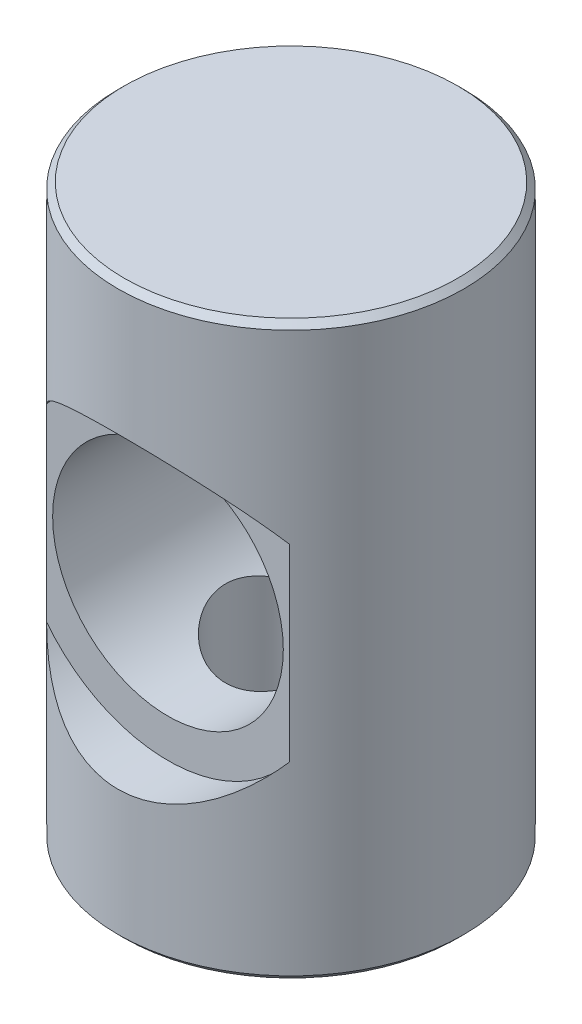
ISO-10303-21;
HEADER;
FILE_DESCRIPTION(('STEP AP214'),'2;1');
FILE_NAME('part.step','',(''),(''),'','','');
FILE_SCHEMA(('AUTOMOTIVE_DESIGN { 1 0 10303 214 1 1 1 1 }'));
ENDSEC;
DATA;
#1=APPLICATION_CONTEXT('core data for automotive mechanical design processes');
#2=APPLICATION_PROTOCOL_DEFINITION('international standard','automotive_design',2000,#1);
#3=PRODUCT_CONTEXT('',#1,'mechanical');
#4=PRODUCT('Part','Part','',(#3));
#5=PRODUCT_RELATED_PRODUCT_CATEGORY('part','',(#4));
#6=PRODUCT_DEFINITION_FORMATION('','',#4);
#7=PRODUCT_DEFINITION_CONTEXT('part definition',#1,'design');
#8=PRODUCT_DEFINITION('design','',#6,#7);
#9=PRODUCT_DEFINITION_SHAPE('','',#8);
#10=(LENGTH_UNIT() NAMED_UNIT(*) SI_UNIT(.MILLI.,.METRE.));
#11=(NAMED_UNIT(*) PLANE_ANGLE_UNIT() SI_UNIT($,.RADIAN.));
#12=(NAMED_UNIT(*) SI_UNIT($,.STERADIAN.) SOLID_ANGLE_UNIT());
#13=UNCERTAINTY_MEASURE_WITH_UNIT(LENGTH_MEASURE(1.E-05),#10,'distance_accuracy_value','');
#14=(GEOMETRIC_REPRESENTATION_CONTEXT(3) GLOBAL_UNCERTAINTY_ASSIGNED_CONTEXT((#13)) GLOBAL_UNIT_ASSIGNED_CONTEXT((#10,
#11,#12)) REPRESENTATION_CONTEXT('',''));
#15=CARTESIAN_POINT('',(0.,0.,0.));
#16=DIRECTION('',(0.,0.,1.));
#17=DIRECTION('',(1.,0.,0.));
#18=AXIS2_PLACEMENT_3D('',#15,#16,#17);
#19=CARTESIAN_POINT('',(0.,11.7983,-7.1755));
#20=DIRECTION('',(0.,0.,1.));
#21=DIRECTION('',(1.,0.,0.));
#22=AXIS2_PLACEMENT_3D('',#19,#20,#21);
#23=CYLINDRICAL_SURFACE('',#22,4.7625);
#24=CARTESIAN_POINT('',(0.,7.0358,-2.7051));
#25=CARTESIAN_POINT('',(0.139598513535539,7.03580547288718,-2.70509388724314));
#26=CARTESIAN_POINT('',(0.279443617879836,7.04200606483683,-2.69421895855618));
#27=CARTESIAN_POINT('',(0.554982231335633,7.06621372694349,-2.65124621837782));
#28=CARTESIAN_POINT('',(0.690663728859827,7.08425210760339,-2.61909212238831));
#29=CARTESIAN_POINT('',(0.953307604271186,7.13029142081531,-2.53528686503882));
#30=CARTESIAN_POINT('',(1.0803080884865,7.15824496251432,-2.48372837922519));
#31=CARTESIAN_POINT('',(1.32351763068693,7.2216719628864,-2.36311450446601));
#32=CARTESIAN_POINT('',(1.43972990413905,7.25714317047543,-2.29406435200575));
#33=CARTESIAN_POINT('',(1.66749727812787,7.3355225029281,-2.13487416514347));
#34=CARTESIAN_POINT('',(1.77812055655335,7.37878155278169,-2.04357671978144));
#35=CARTESIAN_POINT('',(1.98339098875726,7.4670095719528,-1.84503421389969));
#36=CARTESIAN_POINT('',(2.07801927872037,7.51198048467188,-1.73777059995732));
#37=CARTESIAN_POINT('',(2.25884554164129,7.60421077799893,-1.49674683201987));
#38=CARTESIAN_POINT('',(2.34305643516794,7.65119973414909,-1.36137940766609));
#39=CARTESIAN_POINT('',(2.48716262428836,7.73597831901892,-1.07567786118393));
#40=CARTESIAN_POINT('',(2.54709439806289,7.77378171413099,-0.925366617794619));
#41=CARTESIAN_POINT('',(2.6294752923763,7.82726373264735,-0.647736355449101));
#42=CARTESIAN_POINT('',(2.65725695285471,7.8459737133589,-0.522584362376679));
#43=CARTESIAN_POINT('',(2.69479936165856,7.87146908830447,-0.268463882345479));
#44=CARTESIAN_POINT('',(2.7045790814172,7.87826703572944,-0.139499558879811));
#45=CARTESIAN_POINT('',(2.70558094362302,7.87895840350973,0.11870099291141));
#46=CARTESIAN_POINT('',(2.69677889188143,7.87283499976808,0.247937356582351));
#47=CARTESIAN_POINT('',(2.66108750827131,7.84855753560165,0.502750133610326));
#48=CARTESIAN_POINT('',(2.63418587511232,7.83039529316437,0.628323997166864));
#49=CARTESIAN_POINT('',(2.56371735968654,7.78451145815584,0.872364524166685));
#50=CARTESIAN_POINT('',(2.52019949812748,7.75681800775234,0.990850918736955));
#51=CARTESIAN_POINT('',(2.41800681540356,7.69486066580838,1.21921298557874));
#52=CARTESIAN_POINT('',(2.35932616873142,7.66059425025634,1.32908532715714));
#53=CARTESIAN_POINT('',(2.21771468055158,7.5827754197113,1.55558864658099));
#54=CARTESIAN_POINT('',(2.13241455540246,7.53861197242066,1.67053153371503));
#55=CARTESIAN_POINT('',(1.94490937691345,7.44979108376824,1.88554687579623));
#56=CARTESIAN_POINT('',(1.84269014010274,7.40513325752352,1.98560671936528));
#57=CARTESIAN_POINT('',(1.61049832212182,7.31445878254344,2.17924529052499));
#58=CARTESIAN_POINT('',(1.47870409803352,7.26884232137625,2.27086913507212));
#59=CARTESIAN_POINT('',(1.268959712508,7.2073853263005,2.39035717589544));
#60=CARTESIAN_POINT('',(1.19700557453879,7.18805474867707,2.42720613136666));
#61=CARTESIAN_POINT('',(1.04950713192392,7.15226059279092,2.49452575022973));
#62=CARTESIAN_POINT('',(0.973965028305614,7.13579528502795,2.52500026354689));
#63=CARTESIAN_POINT('',(0.825175357767316,7.10726272974559,2.57729229440749));
#64=CARTESIAN_POINT('',(0.752129675937687,7.09497026318962,2.59956235749483));
#65=CARTESIAN_POINT('',(0.603999678207199,7.07366398708793,2.63791577779052));
#66=CARTESIAN_POINT('',(0.528916478874027,7.06464841928044,2.65400245304174));
#67=CARTESIAN_POINT('',(0.377353853335844,7.05016382177245,2.67975214709635));
#68=CARTESIAN_POINT('',(0.300875223128855,7.04469283138577,2.68941871726108));
#69=CARTESIAN_POINT('',(0.147224740958503,7.03745335249961,2.70219240187055));
#70=CARTESIAN_POINT('',(0.0700529653863203,7.03568446090242,2.70530023045476));
#71=CARTESIAN_POINT('',(-0.142933160960142,7.03601801551939,2.70472176917249));
#72=CARTESIAN_POINT('',(-0.278806362450237,7.04207712251871,2.69408962804865));
#73=CARTESIAN_POINT('',(-0.546389546460427,7.06533551947889,2.6528081411293));
#74=CARTESIAN_POINT('',(-0.678099442627536,7.08253504034929,2.62215838042459));
#75=CARTESIAN_POINT('',(-0.93289924645551,7.1262904933274,2.54262124788312));
#76=CARTESIAN_POINT('',(-1.05605455519361,7.15276314789129,2.49389598082207));
#77=CARTESIAN_POINT('',(-1.29253054735398,7.21292286537831,2.3799538390901));
#78=CARTESIAN_POINT('',(-1.40584879748927,7.24661170618613,2.31473289958806));
#79=CARTESIAN_POINT('',(-1.63212183800534,7.3224472491687,2.16200485334383));
#80=CARTESIAN_POINT('',(-1.74381456129874,7.36510910647124,2.07288591911232));
#81=CARTESIAN_POINT('',(-1.95152649102028,7.45253425903628,1.8786604374274));
#82=CARTESIAN_POINT('',(-2.04752762794855,7.4972999016075,1.77353572389187));
#83=CARTESIAN_POINT('',(-2.2317971492989,7.58971047501905,1.53673403892198));
#84=CARTESIAN_POINT('',(-2.31807618934843,7.63713597420328,1.40341111666304));
#85=CARTESIAN_POINT('',(-2.46675793806148,7.72350705207627,1.12158920338567));
#86=CARTESIAN_POINT('',(-2.5291929127244,7.762464059409,0.9731110680307));
#87=CARTESIAN_POINT('',(-2.61677855136694,7.81885365118105,0.697344699936143));
#88=CARTESIAN_POINT('',(-2.64703195880351,7.8391006333707,0.572255043217301));
#89=CARTESIAN_POINT('',(-2.68945683189458,7.86779009870936,0.317773895929312));
#90=CARTESIAN_POINT('',(-2.70164832365358,7.87624565496082,0.188387332592918));
#91=CARTESIAN_POINT('',(-2.7072830924293,7.88013202990089,-0.0712334422635723));
#92=CARTESIAN_POINT('',(-2.70069194762885,7.87553893515282,-0.201468773103683));
#93=CARTESIAN_POINT('',(-2.66908439923395,7.85396967346855,-0.458657010653896));
#94=CARTESIAN_POINT('',(-2.64405628496442,7.83698563619956,-0.585607778021796));
#95=CARTESIAN_POINT('',(-2.57732921499981,7.79326265878474,-0.831219724967886));
#96=CARTESIAN_POINT('',(-2.53586929121589,7.76666404878555,-0.94997227642034));
#97=CARTESIAN_POINT('',(-2.4377758411916,7.70660663969651,-1.17913978046181));
#98=CARTESIAN_POINT('',(-2.38113665008481,7.67314528054155,-1.2895516005497));
#99=CARTESIAN_POINT('',(-2.2442514870803,7.59689898929474,-1.51694207934727));
#100=CARTESIAN_POINT('',(-2.16171661258919,7.5534712844838,-1.63232803805123));
#101=CARTESIAN_POINT('',(-1.97985971176812,7.46565994063167,-1.8487076726119));
#102=CARTESIAN_POINT('',(-1.88052345704611,7.4212755194191,-1.94968901505964));
#103=CARTESIAN_POINT('',(-1.65368445417372,7.33025875872963,-2.14664168807249));
#104=CARTESIAN_POINT('',(-1.5242323896151,7.28399537648898,-2.2405591762054));
#105=CARTESIAN_POINT('',(-1.2486420371911,7.2001520175552,-2.40502276037978));
#106=CARTESIAN_POINT('',(-1.10251307388522,7.16256722359952,-2.47558183156058));
#107=CARTESIAN_POINT('',(-0.824651045000234,7.10598879778666,-2.57982350696064));
#108=CARTESIAN_POINT('',(-0.694958827582922,7.08488049320418,-2.61782614809186));
#109=CARTESIAN_POINT('',(-0.430305814481,7.0534212933156,-2.67405858662995));
#110=CARTESIAN_POINT('',(-0.295361700531943,7.04303882834559,-2.69234641814238));
#111=CARTESIAN_POINT('',(-0.133233312523908,7.03758862050945,-2.70194947182947));
#112=CARTESIAN_POINT('',(-0.106608184121486,7.03691882921129,-2.70312983633112));
#113=CARTESIAN_POINT('',(-0.053325038454564,7.03602397597321,-2.7047057200024));
#114=CARTESIAN_POINT('',(-0.0266670184161374,7.0357989545334,-2.70510116769868));
#115=CARTESIAN_POINT('',(0.,7.0358,-2.7051));
#116=B_SPLINE_CURVE_WITH_KNOTS('',3,(#24,#25,#26,#27,#28,#29,#30,#31,#32,#33,#34,#35,#36,#37,
#38,#39,#40,#41,#42,#43,#44,#45,#46,#47,#48,#49,#50,#51,#52,#53,#54,#55,#56,#57,#58,#59,#60,#61,
#62,#63,#64,#65,#66,#67,#68,#69,#70,#71,#72,#73,#74,#75,#76,#77,#78,#79,#80,#81,#82,#83,#84,#85,
#86,#87,#88,#89,#90,#91,#92,#93,#94,#95,#96,#97,#98,#99,#100,#101,#102,#103,#104,#105,#106,#107,
#108,#109,#110,#111,#112,#113,#114,#115),.UNSPECIFIED.,.T.,.F.,(4,2,2,2,2,2,2,2,2,2,2,2,2,2,2,2,
2,2,2,2,2,2,2,2,2,2,2,2,2,2,2,2,2,2,2,2,2,2,2,2,2,2,2,2,2,4),(0.,0.418682080450967,
0.83847604671958,1.25629000476041,1.67397902923222,2.12162552943039,2.56979633623652,
3.06594698242048,3.56134939713801,3.94833682805503,4.33491619637355,4.72199921647868,
5.10934558174244,5.49555792980283,5.88191888095883,6.32950557307685,6.77746940011973,
7.27519844188409,7.52425784888182,7.77316639616682,8.00488335972852,8.23647580841864,
8.46794004191603,8.69937907145133,9.10645528059574,9.51353992755777,9.91705870136789,
10.3206770065229,10.7662482873926,11.2123291009746,11.7071242522112,12.2012474495721,
12.5904082112659,12.979137168166,13.3685789833253,13.75826837514,14.1424856370776,
14.5268464881395,14.970194898178,15.4139206589076,15.9108708950965,16.4075446202324,
16.8161629452985,17.2235751160779,17.3035472156212,17.3835265969708),.UNSPECIFIED.);
#117=CARTESIAN_POINT('',(0.,7.0358,-2.7051));
#118=VERTEX_POINT('',#117);
#119=EDGE_CURVE('E283',#118,#118,#116,.T.);
#120=ORIENTED_EDGE('',*,*,#119,.T.);
#121=EDGE_LOOP('',(#120));
#122=FACE_BOUND('',#121,.T.);
#123=CARTESIAN_POINT('',(0.,11.7983,5.08));
#124=DIRECTION('',(0.,0.,1.));
#125=DIRECTION('',(1.,0.,0.));
#126=AXIS2_PLACEMENT_3D('',#123,#124,#125);
#127=CIRCLE('',#126,4.7625);
#128=CARTESIAN_POINT('',(4.7625,11.7983,5.08));
#129=VERTEX_POINT('',#128);
#130=EDGE_CURVE('E107',#129,#129,#127,.F.);
#131=ORIENTED_EDGE('',*,*,#130,.F.);
#132=EDGE_LOOP('',(#131));
#133=FACE_BOUND('',#132,.T.);
#134=CARTESIAN_POINT('',(0.,11.7983,-5.08));
#135=DIRECTION('',(0.,0.,-1.));
#136=DIRECTION('',(-1.,0.,0.));
#137=AXIS2_PLACEMENT_3D('',#134,#135,#136);
#138=CIRCLE('',#137,4.7625);
#139=CARTESIAN_POINT('',(-4.7625,11.7983,-5.08));
#140=VERTEX_POINT('',#139);
#141=EDGE_CURVE('E97',#140,#140,#138,.F.);
#142=ORIENTED_EDGE('',*,*,#141,.F.);
#143=EDGE_LOOP('',(#142));
#144=FACE_BOUND('',#143,.T.);
#145=ADVANCED_FACE('F38',(#122,#133,#144),#23,.F.);
#146=CARTESIAN_POINT('',(0.,23.5966,0.));
#147=DIRECTION('',(0.,-1.,0.));
#148=DIRECTION('',(0.,0.,-1.));
#149=AXIS2_PLACEMENT_3D('',#146,#147,#148);
#150=CYLINDRICAL_SURFACE('',#149,7.1374);
#151=CARTESIAN_POINT('',(0.,0.254000000000029,0.));
#152=DIRECTION('',(0.,1.,0.));
#153=DIRECTION('',(0.,0.,1.));
#154=AXIS2_PLACEMENT_3D('',#151,#152,#153);
#155=CIRCLE('',#154,7.1374);
#156=CARTESIAN_POINT('',(0.,0.254000000000029,7.1374));
#157=VERTEX_POINT('',#156);
#158=EDGE_CURVE('E112',#157,#157,#155,.T.);
#159=ORIENTED_EDGE('',*,*,#158,.T.);
#160=EDGE_LOOP('',(#159));
#161=FACE_BOUND('',#160,.T.);
#162=CARTESIAN_POINT('',(0.,23.3426,0.));
#163=DIRECTION('',(0.,1.,0.));
#164=DIRECTION('',(0.,0.,1.));
#165=AXIS2_PLACEMENT_3D('',#162,#163,#164);
#166=CIRCLE('',#165,7.1374);
#167=CARTESIAN_POINT('',(0.,23.3426,7.1374));
#168=VERTEX_POINT('',#167);
#169=EDGE_CURVE('E121',#168,#168,#166,.F.);
#170=ORIENTED_EDGE('',*,*,#169,.T.);
#171=EDGE_LOOP('',(#170));
#172=FACE_BOUND('',#171,.T.);
#173=CARTESIAN_POINT('',(-5.01358940879685,7.90132409040035,-5.08));
#174=CARTESIAN_POINT('',(-4.90648502878149,7.7635854557502,-5.18572112331707));
#175=CARTESIAN_POINT('',(-4.79340126510848,7.62976711896911,-5.29062160918102));
#176=CARTESIAN_POINT('',(-4.55495119495651,7.37042044768733,-5.49725219651464));
#177=CARTESIAN_POINT('',(-4.42956630516229,7.24490515077608,-5.59897718542717));
#178=CARTESIAN_POINT('',(-4.16534261279244,7.00195995764851,-5.79827942274049));
#179=CARTESIAN_POINT('',(-4.02639358636565,6.88461234622421,-5.89581147762958));
#180=CARTESIAN_POINT('',(-3.73603214738952,6.66038346600335,-6.08394902937854));
#181=CARTESIAN_POINT('',(-3.58462764087743,6.55349565083927,-6.17455885069701));
#182=CARTESIAN_POINT('',(-3.30484095874253,6.37413138754628,-6.32771116138449));
#183=CARTESIAN_POINT('',(-3.17890733179915,6.29931260825521,-6.39199186687382));
#184=CARTESIAN_POINT('',(-2.91986390451783,6.1574943321378,-6.51439819586154));
#185=CARTESIAN_POINT('',(-2.78675581887783,6.09049297895258,-6.57252528031964));
#186=CARTESIAN_POINT('',(-2.51408311019655,5.96526186954583,-6.68156925084875));
#187=CARTESIAN_POINT('',(-2.37453585805806,5.90701013276477,-6.73250418486546));
#188=CARTESIAN_POINT('',(-2.08934089764727,5.79993872343358,-6.82639397690769));
#189=CARTESIAN_POINT('',(-1.94369640414868,5.75111415475468,-6.86935297689583));
#190=CARTESIAN_POINT('',(-1.64553210440703,5.66322656410037,-6.94684607284315));
#191=CARTESIAN_POINT('',(-1.4929564949888,5.62427049120682,-6.9812877752731));
#192=CARTESIAN_POINT('',(-1.18349538064518,5.55755583556956,-7.04035693557952));
#193=CARTESIAN_POINT('',(-1.02660982587839,5.52979738237651,-7.06498427990892));
#194=CARTESIAN_POINT('',(-0.709944239539988,5.48608801235782,-7.10379460252081));
#195=CARTESIAN_POINT('',(-0.550164702351688,5.47013509790566,-7.11797934780339));
#196=CARTESIAN_POINT('',(-0.229273485295923,5.45040573077873,-7.13552517406307));
#197=CARTESIAN_POINT('',(-0.0681620062038429,5.44662747529184,-7.13888785756089));
#198=CARTESIAN_POINT('',(0.230766370769881,5.45099296800301,-7.13500426528504));
#199=CARTESIAN_POINT('',(0.368630338438482,5.45751415121553,-7.12920184013348));
#200=CARTESIAN_POINT('',(0.6431307810693,5.47945159506404,-7.10969750208706));
#201=CARTESIAN_POINT('',(0.779766849102553,5.49487070155182,-7.09599306186613));
#202=CARTESIAN_POINT('',(1.05070985095515,5.53433676593677,-7.06095823796117));
#203=CARTESIAN_POINT('',(1.18501810993927,5.55837863386231,-7.03963235320292));
#204=CARTESIAN_POINT('',(1.45054761727503,5.61470361470149,-6.9897549592306));
#205=CARTESIAN_POINT('',(1.58176766356226,5.64698988058266,-6.96120068564527));
#206=CARTESIAN_POINT('',(1.96800874114835,5.75508252052344,-6.86580612170238));
#207=CARTESIAN_POINT('',(2.21747402764985,5.84240339109374,-6.78898310323563));
#208=CARTESIAN_POINT('',(2.69706982116865,6.04363474646974,-6.61315009165441));
#209=CARTESIAN_POINT('',(2.92718188163154,6.15757021698519,-6.51411925341828));
#210=CARTESIAN_POINT('',(3.30732336353376,6.37442563536606,-6.32741826965322));
#211=CARTESIAN_POINT('',(3.46234707064988,6.47218382464702,-6.24375842699735));
#212=CARTESIAN_POINT('',(3.7605476018623,6.678374219184,-6.06882487582275));
#213=CARTESIAN_POINT('',(3.90372369116022,6.78680708557983,-5.9775506957609));
#214=CARTESIAN_POINT('',(4.17814401405553,7.01319072783886,-5.78906859105549));
#215=CARTESIAN_POINT('',(4.30938568729903,7.13114353586888,-5.69185940058389));
#216=CARTESIAN_POINT('',(4.55994561370261,7.37562905751948,-5.49316976050202));
#217=CARTESIAN_POINT('',(4.67927004152543,7.50215727033194,-5.39169156193111));
#218=CARTESIAN_POINT('',(4.83088286586266,7.67659470989879,-5.25430357798406));
#219=CARTESIAN_POINT('',(4.86838888602788,7.72096543118581,-5.21956343792526));
#220=CARTESIAN_POINT('',(4.94200849827078,7.81051812940347,-5.14991187275229));
#221=CARTESIAN_POINT('',(4.97812467523291,7.85569834596996,-5.11500091676728));
#222=CARTESIAN_POINT('',(5.0135894087969,7.90132409040031,-5.08));
#223=B_SPLINE_CURVE_WITH_KNOTS('',3,(#173,#174,#175,#176,#177,#178,#179,#180,#181,#182,#183,
#184,#185,#186,#187,#188,#189,#190,#191,#192,#193,#194,#195,#196,#197,#198,#199,#200,#201,#202,
#203,#204,#205,#206,#207,#208,#209,#210,#211,#212,#213,#214,#215,#216,#217,#218,#219,#220,#221,
#222),.UNSPECIFIED.,.F.,.F.,(4,2,2,2,2,2,2,2,2,2,2,2,2,2,2,2,2,2,2,2,2,2,2,2,4),(0.,
0.612006445663398,1.2249521193373,1.84337572784972,2.46140978061607,2.94088458183679,
3.42024529222186,3.89838086544293,4.37626744047922,4.85913060401934,5.34199935387605,
5.82478637835434,6.30750190889455,6.7214125983357,7.13545574361017,7.54925488252654,
7.96321251141351,8.78549152442383,9.60854561525155,10.2121657150913,10.8158232238985,
11.419609934532,12.0230821652517,12.2261478476827,12.4288155525972),.UNSPECIFIED.);
#224=CARTESIAN_POINT('',(-5.01358940879685,7.90132409040035,-5.08));
#225=VERTEX_POINT('',#224);
#226=CARTESIAN_POINT('',(5.01358940879685,7.90132409040035,-5.08));
#227=VERTEX_POINT('',#226);
#228=EDGE_CURVE('E11',#225,#227,#223,.T.);
#229=ORIENTED_EDGE('',*,*,#228,.T.);
#230=DIRECTION('',(0.,-1.,0.));
#231=VECTOR('',#230,1.);
#232=CARTESIAN_POINT('',(5.01358940879685,23.5966,-5.08));
#233=LINE('',#232,#231);
#234=CARTESIAN_POINT('',(5.01358940879685,15.6952759095996,-5.08));
#235=VERTEX_POINT('',#234);
#236=EDGE_CURVE('E95',#235,#227,#233,.T.);
#237=ORIENTED_EDGE('',*,*,#236,.F.);
#238=CARTESIAN_POINT('',(5.01358940879685,15.6952759095996,-5.08));
#239=CARTESIAN_POINT('',(4.90648502878149,15.8330145442498,-5.18572112331707));
#240=CARTESIAN_POINT('',(4.79340126510848,15.9668328810309,-5.29062160918102));
#241=CARTESIAN_POINT('',(4.55495119495651,16.2261795523127,-5.49725219651464));
#242=CARTESIAN_POINT('',(4.42956630516229,16.3516948492239,-5.59897718542717));
#243=CARTESIAN_POINT('',(4.16534261279244,16.5946400423515,-5.79827942274049));
#244=CARTESIAN_POINT('',(4.02639358636565,16.7119876537758,-5.89581147762958));
#245=CARTESIAN_POINT('',(3.73603214738952,16.9362165339966,-6.08394902937854));
#246=CARTESIAN_POINT('',(3.58462764087743,17.0431043491607,-6.174558850697));
#247=CARTESIAN_POINT('',(3.30484095874253,17.2224686124537,-6.32771116138449));
#248=CARTESIAN_POINT('',(3.17890733179915,17.2972873917448,-6.39199186687382));
#249=CARTESIAN_POINT('',(2.91986390451783,17.4391056678622,-6.51439819586154));
#250=CARTESIAN_POINT('',(2.78675581887783,17.5061070210474,-6.57252528031964));
#251=CARTESIAN_POINT('',(2.51408311019655,17.6313381304542,-6.68156925084875));
#252=CARTESIAN_POINT('',(2.37453585805806,17.6895898672352,-6.73250418486546));
#253=CARTESIAN_POINT('',(2.08934089764727,17.7966612765664,-6.82639397690769));
#254=CARTESIAN_POINT('',(1.94369640414868,17.8454858452453,-6.86935297689583));
#255=CARTESIAN_POINT('',(1.64553210440703,17.9333734358996,-6.94684607284315));
#256=CARTESIAN_POINT('',(1.4929564949888,17.9723295087932,-6.9812877752731));
#257=CARTESIAN_POINT('',(1.18349538064518,18.0390441644304,-7.04035693557952));
#258=CARTESIAN_POINT('',(1.02660982587839,18.0668026176235,-7.06498427990892));
#259=CARTESIAN_POINT('',(0.709944239539987,18.1105119876422,-7.10379460252081));
#260=CARTESIAN_POINT('',(0.550164702351688,18.1264649020943,-7.11797934780339));
#261=CARTESIAN_POINT('',(0.229273485295923,18.1461942692213,-7.13552517406307));
#262=CARTESIAN_POINT('',(0.0681620062038422,18.1499725247082,-7.13888785756089));
#263=CARTESIAN_POINT('',(-0.230766370769882,18.145607031997,-7.13500426528504));
#264=CARTESIAN_POINT('',(-0.368630338438483,18.1390858487845,-7.12920184013348));
#265=CARTESIAN_POINT('',(-0.643130781069301,18.117148404936,-7.10969750208706));
#266=CARTESIAN_POINT('',(-0.779766849102554,18.1017292984482,-7.09599306186613));
#267=CARTESIAN_POINT('',(-1.05070985095516,18.0622632340632,-7.06095823796117));
#268=CARTESIAN_POINT('',(-1.18501810993928,18.0382213661377,-7.03963235320292));
#269=CARTESIAN_POINT('',(-1.45054761727503,17.9818963852985,-6.9897549592306));
#270=CARTESIAN_POINT('',(-1.58176766356226,17.9496101194173,-6.96120068564527));
#271=CARTESIAN_POINT('',(-1.96800874114835,17.8415174794766,-6.86580612170238));
#272=CARTESIAN_POINT('',(-2.21747402764985,17.7541966089063,-6.78898310323563));
#273=CARTESIAN_POINT('',(-2.69706982116865,17.5529652535303,-6.61315009165441));
#274=CARTESIAN_POINT('',(-2.92718188163154,17.4390297830148,-6.51411925341828));
#275=CARTESIAN_POINT('',(-3.30732336353376,17.2221743646339,-6.32741826965322));
#276=CARTESIAN_POINT('',(-3.46234707064988,17.124416175353,-6.24375842699735));
#277=CARTESIAN_POINT('',(-3.7605476018623,16.918225780816,-6.06882487582275));
#278=CARTESIAN_POINT('',(-3.90372369116022,16.8097929144202,-5.9775506957609));
#279=CARTESIAN_POINT('',(-4.17814401405552,16.5834092721611,-5.78906859105549));
#280=CARTESIAN_POINT('',(-4.30938568729903,16.4654564641311,-5.69185940058389));
#281=CARTESIAN_POINT('',(-4.55994561370261,16.2209709424805,-5.49316976050203));
#282=CARTESIAN_POINT('',(-4.67927004152543,16.0944427296681,-5.39169156193111));
#283=CARTESIAN_POINT('',(-4.83088286586265,15.9200052901012,-5.25430357798406));
#284=CARTESIAN_POINT('',(-4.86838888602788,15.8756345688142,-5.21956343792526));
#285=CARTESIAN_POINT('',(-4.94200849827078,15.7860818705965,-5.14991187275229));
#286=CARTESIAN_POINT('',(-4.97812467523291,15.74090165403,-5.11500091676728));
#287=CARTESIAN_POINT('',(-5.0135894087969,15.6952759095997,-5.08));
#288=B_SPLINE_CURVE_WITH_KNOTS('',3,(#238,#239,#240,#241,#242,#243,#244,#245,#246,#247,#248,
#249,#250,#251,#252,#253,#254,#255,#256,#257,#258,#259,#260,#261,#262,#263,#264,#265,#266,#267,
#268,#269,#270,#271,#272,#273,#274,#275,#276,#277,#278,#279,#280,#281,#282,#283,#284,#285,#286,
#287),.UNSPECIFIED.,.F.,.F.,(4,2,2,2,2,2,2,2,2,2,2,2,2,2,2,2,2,2,2,2,2,2,2,2,4),(0.,
0.612006445663398,1.2249521193373,1.84337572784972,2.46140978061607,2.94088458183679,
3.42024529222186,3.89838086544293,4.37626744047922,4.85913060401934,5.34199935387605,
5.82478637835434,6.30750190889455,6.7214125983357,7.13545574361017,7.54925488252654,
7.96321251141351,8.78549152442383,9.60854561525155,10.2121657150913,10.8158232238984,
11.419609934532,12.0230821652517,12.2261478476827,12.4288155525972),.UNSPECIFIED.);
#289=CARTESIAN_POINT('',(-5.01358940879685,15.6952759095996,-5.08));
#290=VERTEX_POINT('',#289);
#291=EDGE_CURVE('E53',#235,#290,#288,.T.);
#292=ORIENTED_EDGE('',*,*,#291,.T.);
#293=DIRECTION('',(0.,-1.,0.));
#294=VECTOR('',#293,1.);
#295=CARTESIAN_POINT('',(-5.01358940879685,23.5966,-5.08));
#296=LINE('',#295,#294);
#297=EDGE_CURVE('E96',#225,#290,#296,.F.);
#298=ORIENTED_EDGE('',*,*,#297,.F.);
#299=EDGE_LOOP('',(#229,#237,#292,#298));
#300=FACE_BOUND('',#299,.T.);
#301=DIRECTION('',(0.,-1.,0.));
#302=VECTOR('',#301,1.);
#303=CARTESIAN_POINT('',(-5.01358940879685,23.5966,5.08));
#304=LINE('',#303,#302);
#305=CARTESIAN_POINT('',(-5.01358940879685,15.6952759095996,5.08));
#306=VERTEX_POINT('',#305);
#307=CARTESIAN_POINT('',(-5.01358940879685,7.90132409040035,5.08));
#308=VERTEX_POINT('',#307);
#309=EDGE_CURVE('E110',#306,#308,#304,.T.);
#310=ORIENTED_EDGE('',*,*,#309,.F.);
#311=CARTESIAN_POINT('',(5.01358940879685,15.6952759095996,5.08));
#312=CARTESIAN_POINT('',(4.90648502878149,15.8330145442498,5.18572112331707));
#313=CARTESIAN_POINT('',(4.79340126510848,15.9668328810309,5.29062160918102));
#314=CARTESIAN_POINT('',(4.55495119495651,16.2261795523127,5.49725219651464));
#315=CARTESIAN_POINT('',(4.42956630516229,16.3516948492239,5.59897718542717));
#316=CARTESIAN_POINT('',(4.16534261279244,16.5946400423515,5.79827942274049));
#317=CARTESIAN_POINT('',(4.02639358636565,16.7119876537758,5.89581147762958));
#318=CARTESIAN_POINT('',(3.73603214738952,16.9362165339966,6.08394902937854));
#319=CARTESIAN_POINT('',(3.58462764087743,17.0431043491607,6.174558850697));
#320=CARTESIAN_POINT('',(3.30484095874253,17.2224686124537,6.32771116138449));
#321=CARTESIAN_POINT('',(3.17890733179915,17.2972873917448,6.39199186687382));
#322=CARTESIAN_POINT('',(2.91986390451783,17.4391056678622,6.51439819586154));
#323=CARTESIAN_POINT('',(2.78675581887783,17.5061070210474,6.57252528031964));
#324=CARTESIAN_POINT('',(2.51408311019655,17.6313381304542,6.68156925084875));
#325=CARTESIAN_POINT('',(2.37453585805806,17.6895898672352,6.73250418486546));
#326=CARTESIAN_POINT('',(2.08934089764727,17.7966612765664,6.82639397690769));
#327=CARTESIAN_POINT('',(1.94369640414868,17.8454858452453,6.86935297689583));
#328=CARTESIAN_POINT('',(1.64553210440703,17.9333734358996,6.94684607284315));
#329=CARTESIAN_POINT('',(1.4929564949888,17.9723295087932,6.9812877752731));
#330=CARTESIAN_POINT('',(1.18349538064518,18.0390441644304,7.04035693557952));
#331=CARTESIAN_POINT('',(1.02660982587839,18.0668026176235,7.06498427990892));
#332=CARTESIAN_POINT('',(0.709944239539987,18.1105119876422,7.10379460252081));
#333=CARTESIAN_POINT('',(0.550164702351688,18.1264649020943,7.11797934780339));
#334=CARTESIAN_POINT('',(0.229273485295923,18.1461942692213,7.13552517406307));
#335=CARTESIAN_POINT('',(0.0681620062038422,18.1499725247082,7.13888785756089));
#336=CARTESIAN_POINT('',(-0.230766370769882,18.145607031997,7.13500426528504));
#337=CARTESIAN_POINT('',(-0.368630338438483,18.1390858487845,7.12920184013348));
#338=CARTESIAN_POINT('',(-0.643130781069301,18.117148404936,7.10969750208706));
#339=CARTESIAN_POINT('',(-0.779766849102554,18.1017292984482,7.09599306186613));
#340=CARTESIAN_POINT('',(-1.05070985095516,18.0622632340632,7.06095823796117));
#341=CARTESIAN_POINT('',(-1.18501810993928,18.0382213661377,7.03963235320292));
#342=CARTESIAN_POINT('',(-1.45054761727503,17.9818963852985,6.9897549592306));
#343=CARTESIAN_POINT('',(-1.58176766356226,17.9496101194173,6.96120068564527));
#344=CARTESIAN_POINT('',(-1.96800874114835,17.8415174794766,6.86580612170238));
#345=CARTESIAN_POINT('',(-2.21747402764985,17.7541966089063,6.78898310323563));
#346=CARTESIAN_POINT('',(-2.69706982116865,17.5529652535303,6.61315009165441));
#347=CARTESIAN_POINT('',(-2.92718188163154,17.4390297830148,6.51411925341828));
#348=CARTESIAN_POINT('',(-3.30732336353376,17.2221743646339,6.32741826965322));
#349=CARTESIAN_POINT('',(-3.46234707064988,17.124416175353,6.24375842699735));
#350=CARTESIAN_POINT('',(-3.7605476018623,16.918225780816,6.06882487582275));
#351=CARTESIAN_POINT('',(-3.90372369116022,16.8097929144202,5.9775506957609));
#352=CARTESIAN_POINT('',(-4.17814401405552,16.5834092721611,5.78906859105549));
#353=CARTESIAN_POINT('',(-4.30938568729903,16.4654564641311,5.69185940058389));
#354=CARTESIAN_POINT('',(-4.55994561370261,16.2209709424805,5.49316976050203));
#355=CARTESIAN_POINT('',(-4.67927004152543,16.0944427296681,5.39169156193111));
#356=CARTESIAN_POINT('',(-4.83088286586265,15.9200052901012,5.25430357798406));
#357=CARTESIAN_POINT('',(-4.86838888602788,15.8756345688142,5.21956343792526));
#358=CARTESIAN_POINT('',(-4.94200849827078,15.7860818705965,5.14991187275229));
#359=CARTESIAN_POINT('',(-4.97812467523291,15.74090165403,5.11500091676728));
#360=CARTESIAN_POINT('',(-5.0135894087969,15.6952759095997,5.08));
#361=B_SPLINE_CURVE_WITH_KNOTS('',3,(#311,#312,#313,#314,#315,#316,#317,#318,#319,#320,#321,
#322,#323,#324,#325,#326,#327,#328,#329,#330,#331,#332,#333,#334,#335,#336,#337,#338,#339,#340,
#341,#342,#343,#344,#345,#346,#347,#348,#349,#350,#351,#352,#353,#354,#355,#356,#357,#358,#359,
#360),.UNSPECIFIED.,.F.,.F.,(4,2,2,2,2,2,2,2,2,2,2,2,2,2,2,2,2,2,2,2,2,2,2,2,4),(0.,
0.612006445663398,1.2249521193373,1.84337572784972,2.46140978061607,2.94088458183679,
3.42024529222186,3.89838086544293,4.37626744047922,4.85913060401934,5.34199935387605,
5.82478637835434,6.30750190889455,6.7214125983357,7.13545574361017,7.54925488252654,
7.96321251141351,8.78549152442383,9.60854561525155,10.2121657150913,10.8158232238984,
11.419609934532,12.0230821652517,12.2261478476827,12.4288155525972),.UNSPECIFIED.);
#362=CARTESIAN_POINT('',(5.01358940879685,15.6952759095996,5.08));
#363=VERTEX_POINT('',#362);
#364=EDGE_CURVE('E93',#363,#306,#361,.T.);
#365=ORIENTED_EDGE('',*,*,#364,.F.);
#366=DIRECTION('',(0.,-1.,0.));
#367=VECTOR('',#366,1.);
#368=CARTESIAN_POINT('',(5.01358940879685,23.5966,5.08));
#369=LINE('',#368,#367);
#370=CARTESIAN_POINT('',(5.01358940879685,7.90132409040035,5.08));
#371=VERTEX_POINT('',#370);
#372=EDGE_CURVE('E108',#371,#363,#369,.F.);
#373=ORIENTED_EDGE('',*,*,#372,.F.);
#374=CARTESIAN_POINT('',(-5.01358940879685,7.90132409040035,5.08));
#375=CARTESIAN_POINT('',(-4.90648502878149,7.7635854557502,5.18572112331707));
#376=CARTESIAN_POINT('',(-4.79340126510848,7.62976711896911,5.29062160918102));
#377=CARTESIAN_POINT('',(-4.55495119495651,7.37042044768733,5.49725219651464));
#378=CARTESIAN_POINT('',(-4.42956630516229,7.24490515077608,5.59897718542717));
#379=CARTESIAN_POINT('',(-4.16534261279244,7.00195995764851,5.79827942274049));
#380=CARTESIAN_POINT('',(-4.02639358636565,6.88461234622421,5.89581147762958));
#381=CARTESIAN_POINT('',(-3.73603214738952,6.66038346600335,6.08394902937854));
#382=CARTESIAN_POINT('',(-3.58462764087743,6.55349565083927,6.17455885069701));
#383=CARTESIAN_POINT('',(-3.30484095874253,6.37413138754628,6.32771116138449));
#384=CARTESIAN_POINT('',(-3.17890733179915,6.29931260825521,6.39199186687382));
#385=CARTESIAN_POINT('',(-2.91986390451783,6.1574943321378,6.51439819586154));
#386=CARTESIAN_POINT('',(-2.78675581887783,6.09049297895258,6.57252528031964));
#387=CARTESIAN_POINT('',(-2.51408311019655,5.96526186954583,6.68156925084875));
#388=CARTESIAN_POINT('',(-2.37453585805806,5.90701013276477,6.73250418486546));
#389=CARTESIAN_POINT('',(-2.08934089764727,5.79993872343358,6.82639397690769));
#390=CARTESIAN_POINT('',(-1.94369640414868,5.75111415475468,6.86935297689583));
#391=CARTESIAN_POINT('',(-1.64553210440703,5.66322656410037,6.94684607284315));
#392=CARTESIAN_POINT('',(-1.4929564949888,5.62427049120682,6.9812877752731));
#393=CARTESIAN_POINT('',(-1.18349538064518,5.55755583556956,7.04035693557952));
#394=CARTESIAN_POINT('',(-1.02660982587839,5.52979738237651,7.06498427990892));
#395=CARTESIAN_POINT('',(-0.709944239539988,5.48608801235782,7.10379460252081));
#396=CARTESIAN_POINT('',(-0.550164702351688,5.47013509790566,7.11797934780339));
#397=CARTESIAN_POINT('',(-0.229273485295923,5.45040573077873,7.13552517406307));
#398=CARTESIAN_POINT('',(-0.0681620062038429,5.44662747529184,7.13888785756089));
#399=CARTESIAN_POINT('',(0.230766370769881,5.45099296800301,7.13500426528504));
#400=CARTESIAN_POINT('',(0.368630338438482,5.45751415121553,7.12920184013348));
#401=CARTESIAN_POINT('',(0.6431307810693,5.47945159506404,7.10969750208706));
#402=CARTESIAN_POINT('',(0.779766849102553,5.49487070155182,7.09599306186613));
#403=CARTESIAN_POINT('',(1.05070985095515,5.53433676593677,7.06095823796117));
#404=CARTESIAN_POINT('',(1.18501810993927,5.55837863386231,7.03963235320292));
#405=CARTESIAN_POINT('',(1.45054761727503,5.61470361470149,6.9897549592306));
#406=CARTESIAN_POINT('',(1.58176766356226,5.64698988058266,6.96120068564527));
#407=CARTESIAN_POINT('',(1.96800874114835,5.75508252052344,6.86580612170238));
#408=CARTESIAN_POINT('',(2.21747402764985,5.84240339109374,6.78898310323563));
#409=CARTESIAN_POINT('',(2.69706982116865,6.04363474646974,6.61315009165441));
#410=CARTESIAN_POINT('',(2.92718188163154,6.15757021698519,6.51411925341828));
#411=CARTESIAN_POINT('',(3.30732336353376,6.37442563536606,6.32741826965322));
#412=CARTESIAN_POINT('',(3.46234707064988,6.47218382464702,6.24375842699735));
#413=CARTESIAN_POINT('',(3.7605476018623,6.678374219184,6.06882487582275));
#414=CARTESIAN_POINT('',(3.90372369116022,6.78680708557983,5.9775506957609));
#415=CARTESIAN_POINT('',(4.17814401405553,7.01319072783886,5.78906859105549));
#416=CARTESIAN_POINT('',(4.30938568729903,7.13114353586888,5.69185940058389));
#417=CARTESIAN_POINT('',(4.55994561370261,7.37562905751948,5.49316976050202));
#418=CARTESIAN_POINT('',(4.67927004152543,7.50215727033194,5.39169156193111));
#419=CARTESIAN_POINT('',(4.83088286586266,7.67659470989879,5.25430357798406));
#420=CARTESIAN_POINT('',(4.86838888602788,7.72096543118581,5.21956343792526));
#421=CARTESIAN_POINT('',(4.94200849827078,7.81051812940347,5.14991187275229));
#422=CARTESIAN_POINT('',(4.97812467523291,7.85569834596996,5.11500091676728));
#423=CARTESIAN_POINT('',(5.0135894087969,7.90132409040031,5.08));
#424=B_SPLINE_CURVE_WITH_KNOTS('',3,(#374,#375,#376,#377,#378,#379,#380,#381,#382,#383,#384,
#385,#386,#387,#388,#389,#390,#391,#392,#393,#394,#395,#396,#397,#398,#399,#400,#401,#402,#403,
#404,#405,#406,#407,#408,#409,#410,#411,#412,#413,#414,#415,#416,#417,#418,#419,#420,#421,#422,
#423),.UNSPECIFIED.,.F.,.F.,(4,2,2,2,2,2,2,2,2,2,2,2,2,2,2,2,2,2,2,2,2,2,2,2,4),(0.,
0.612006445663398,1.2249521193373,1.84337572784972,2.46140978061607,2.94088458183679,
3.42024529222186,3.89838086544293,4.37626744047922,4.85913060401934,5.34199935387605,
5.82478637835434,6.30750190889455,6.7214125983357,7.13545574361017,7.54925488252654,
7.96321251141351,8.78549152442383,9.60854561525155,10.2121657150913,10.8158232238985,
11.419609934532,12.0230821652517,12.2261478476827,12.4288155525972),.UNSPECIFIED.);
#425=EDGE_CURVE('E124',#308,#371,#424,.T.);
#426=ORIENTED_EDGE('',*,*,#425,.F.);
#427=EDGE_LOOP('',(#310,#365,#373,#426));
#428=FACE_BOUND('',#427,.T.);
#429=ADVANCED_FACE('F99',(#161,#172,#300,#428),#150,.T.);
#430=CARTESIAN_POINT('',(0.,23.5966,0.));
#431=DIRECTION('',(0.,1.,0.));
#432=DIRECTION('',(0.,0.,1.));
#433=AXIS2_PLACEMENT_3D('',#430,#431,#432);
#434=PLANE('',#433);
#435=CARTESIAN_POINT('',(0.,23.5966,0.));
#436=DIRECTION('',(0.,1.,0.));
#437=DIRECTION('',(0.,0.,1.));
#438=AXIS2_PLACEMENT_3D('',#435,#436,#437);
#439=CIRCLE('',#438,6.88340000000002);
#440=CARTESIAN_POINT('',(0.,23.5966,6.88340000000002));
#441=VERTEX_POINT('',#440);
#442=EDGE_CURVE('E118',#441,#441,#439,.T.);
#443=ORIENTED_EDGE('',*,*,#442,.T.);
#444=EDGE_LOOP('',(#443));
#445=FACE_BOUND('',#444,.T.);
#446=ADVANCED_FACE('F152',(#445),#434,.T.);
#447=CARTESIAN_POINT('',(0.,0.,0.));
#448=DIRECTION('',(0.,1.,0.));
#449=DIRECTION('',(0.,0.,1.));
#450=AXIS2_PLACEMENT_3D('',#447,#448,#449);
#451=PLANE('',#450);
#452=CARTESIAN_POINT('',(0.,0.,0.));
#453=DIRECTION('',(0.,-1.,0.));
#454=DIRECTION('',(0.,0.,-1.));
#455=AXIS2_PLACEMENT_3D('',#452,#453,#454);
#456=CIRCLE('',#455,2.7051);
#457=CARTESIAN_POINT('',(0.,0.,-2.7051));
#458=VERTEX_POINT('',#457);
#459=EDGE_CURVE('E166',#458,#458,#456,.T.);
#460=ORIENTED_EDGE('',*,*,#459,.F.);
#461=EDGE_LOOP('',(#460));
#462=FACE_BOUND('',#461,.T.);
#463=CARTESIAN_POINT('',(0.,0.,0.));
#464=DIRECTION('',(0.,1.,0.));
#465=DIRECTION('',(0.,0.,1.));
#466=AXIS2_PLACEMENT_3D('',#463,#464,#465);
#467=CIRCLE('',#466,6.88339999999997);
#468=CARTESIAN_POINT('',(0.,0.,6.88339999999997));
#469=VERTEX_POINT('',#468);
#470=EDGE_CURVE('E115',#469,#469,#467,.F.);
#471=ORIENTED_EDGE('',*,*,#470,.T.);
#472=EDGE_LOOP('',(#471));
#473=FACE_BOUND('',#472,.T.);
#474=ADVANCED_FACE('F154',(#462,#473),#451,.F.);
#475=CARTESIAN_POINT('',(0.,0.254000000000029,0.));
#476=DIRECTION('',(0.,1.,0.));
#477=DIRECTION('',(0.,0.,1.));
#478=AXIS2_PLACEMENT_3D('',#475,#476,#477);
#479=CONICAL_SURFACE('',#478,7.1374,0.785398163397447);
#480=ORIENTED_EDGE('',*,*,#470,.F.);
#481=EDGE_LOOP('',(#480));
#482=FACE_BOUND('',#481,.T.);
#483=ORIENTED_EDGE('',*,*,#158,.F.);
#484=EDGE_LOOP('',(#483));
#485=FACE_BOUND('',#484,.T.);
#486=ADVANCED_FACE('F157',(#482,#485),#479,.T.);
#487=CARTESIAN_POINT('',(0.,23.5966,0.));
#488=DIRECTION('',(0.,-1.,0.));
#489=DIRECTION('',(0.,0.,-1.));
#490=AXIS2_PLACEMENT_3D('',#487,#488,#489);
#491=CONICAL_SURFACE('',#490,6.88340000000002,0.785398163397447);
#492=ORIENTED_EDGE('',*,*,#169,.F.);
#493=EDGE_LOOP('',(#492));
#494=FACE_BOUND('',#493,.T.);
#495=ORIENTED_EDGE('',*,*,#442,.F.);
#496=EDGE_LOOP('',(#495));
#497=FACE_BOUND('',#496,.T.);
#498=ADVANCED_FACE('F41',(#494,#497),#491,.T.);
#499=CARTESIAN_POINT('',(0.,11.7983,7.1374));
#500=DIRECTION('',(0.,0.,-1.));
#501=DIRECTION('',(-1.,0.,0.));
#502=AXIS2_PLACEMENT_3D('',#499,#500,#501);
#503=CYLINDRICAL_SURFACE('',#502,6.35);
#504=ORIENTED_EDGE('',*,*,#364,.T.);
#505=CARTESIAN_POINT('',(0.,11.7983,5.08));
#506=DIRECTION('',(0.,0.,1.));
#507=DIRECTION('',(1.,0.,0.));
#508=AXIS2_PLACEMENT_3D('',#505,#506,#507);
#509=CIRCLE('',#508,6.35);
#510=EDGE_CURVE('E102',#363,#306,#509,.T.);
#511=ORIENTED_EDGE('',*,*,#510,.F.);
#512=EDGE_LOOP('',(#504,#511));
#513=FACE_BOUND('',#512,.T.);
#514=ADVANCED_FACE('F140',(#513),#503,.F.);
#515=EDGE_CURVE('E68',#308,#371,#509,.T.);
#516=ORIENTED_EDGE('',*,*,#515,.F.);
#517=ORIENTED_EDGE('',*,*,#425,.T.);
#518=EDGE_LOOP('',(#516,#517));
#519=FACE_BOUND('',#518,.T.);
#520=ADVANCED_FACE('F145',(#519),#503,.F.);
#521=CARTESIAN_POINT('',(0.,11.7983,5.08));
#522=DIRECTION('',(0.,0.,1.));
#523=DIRECTION('',(1.,0.,0.));
#524=AXIS2_PLACEMENT_3D('',#521,#522,#523);
#525=PLANE('',#524);
#526=ORIENTED_EDGE('',*,*,#130,.T.);
#527=EDGE_LOOP('',(#526));
#528=FACE_BOUND('',#527,.T.);
#529=ORIENTED_EDGE('',*,*,#309,.T.);
#530=ORIENTED_EDGE('',*,*,#515,.T.);
#531=ORIENTED_EDGE('',*,*,#372,.T.);
#532=ORIENTED_EDGE('',*,*,#510,.T.);
#533=EDGE_LOOP('',(#529,#530,#531,#532));
#534=FACE_BOUND('',#533,.T.);
#535=ADVANCED_FACE('F147',(#528,#534),#525,.T.);
#536=CARTESIAN_POINT('',(0.,11.7983,-7.1374));
#537=DIRECTION('',(0.,0.,1.));
#538=DIRECTION('',(1.,0.,0.));
#539=AXIS2_PLACEMENT_3D('',#536,#537,#538);
#540=CYLINDRICAL_SURFACE('',#539,6.35);
#541=CARTESIAN_POINT('',(0.,11.7983,-5.08));
#542=DIRECTION('',(0.,0.,1.));
#543=DIRECTION('',(1.,0.,0.));
#544=AXIS2_PLACEMENT_3D('',#541,#542,#543);
#545=CIRCLE('',#544,6.35);
#546=EDGE_CURVE('E60',#225,#227,#545,.T.);
#547=ORIENTED_EDGE('',*,*,#546,.T.);
#548=ORIENTED_EDGE('',*,*,#228,.F.);
#549=EDGE_LOOP('',(#547,#548));
#550=FACE_BOUND('',#549,.T.);
#551=ADVANCED_FACE('F199',(#550),#540,.F.);
#552=EDGE_CURVE('E89',#235,#290,#545,.T.);
#553=ORIENTED_EDGE('',*,*,#552,.T.);
#554=ORIENTED_EDGE('',*,*,#291,.F.);
#555=EDGE_LOOP('',(#553,#554));
#556=FACE_BOUND('',#555,.T.);
#557=ADVANCED_FACE('F88',(#556),#540,.F.);
#558=CARTESIAN_POINT('',(0.,11.7983,-5.08));
#559=DIRECTION('',(0.,0.,-1.));
#560=DIRECTION('',(1.,0.,0.));
#561=AXIS2_PLACEMENT_3D('',#558,#559,#560);
#562=PLANE('',#561);
#563=ORIENTED_EDGE('',*,*,#141,.T.);
#564=EDGE_LOOP('',(#563));
#565=FACE_BOUND('',#564,.T.);
#566=ORIENTED_EDGE('',*,*,#236,.T.);
#567=ORIENTED_EDGE('',*,*,#546,.F.);
#568=ORIENTED_EDGE('',*,*,#297,.T.);
#569=ORIENTED_EDGE('',*,*,#552,.F.);
#570=EDGE_LOOP('',(#566,#567,#568,#569));
#571=FACE_BOUND('',#570,.T.);
#572=ADVANCED_FACE('F94',(#565,#571),#562,.T.);
#573=CARTESIAN_POINT('',(0.,0.,0.));
#574=DIRECTION('',(0.,-1.,0.));
#575=DIRECTION('',(0.,0.,-1.));
#576=AXIS2_PLACEMENT_3D('',#573,#574,#575);
#577=CYLINDRICAL_SURFACE('',#576,2.7051);
#578=ORIENTED_EDGE('',*,*,#119,.F.);
#579=EDGE_LOOP('',(#578));
#580=FACE_BOUND('',#579,.T.);
#581=ORIENTED_EDGE('',*,*,#459,.T.);
#582=EDGE_LOOP('',(#581));
#583=FACE_BOUND('',#582,.T.);
#584=ADVANCED_FACE('F218',(#580,#583),#577,.F.);
#585=CLOSED_SHELL('',(#145,#429,#446,#474,#486,#498,#514,#520,#535,#551,#557,#572,#584));
#586=MANIFOLD_SOLID_BREP('B2',#585);
#587=ADVANCED_BREP_SHAPE_REPRESENTATION('',(#18,#586),#14);
#588=SHAPE_DEFINITION_REPRESENTATION(#9,#587);
ENDSEC;
END-ISO-10303-21;
